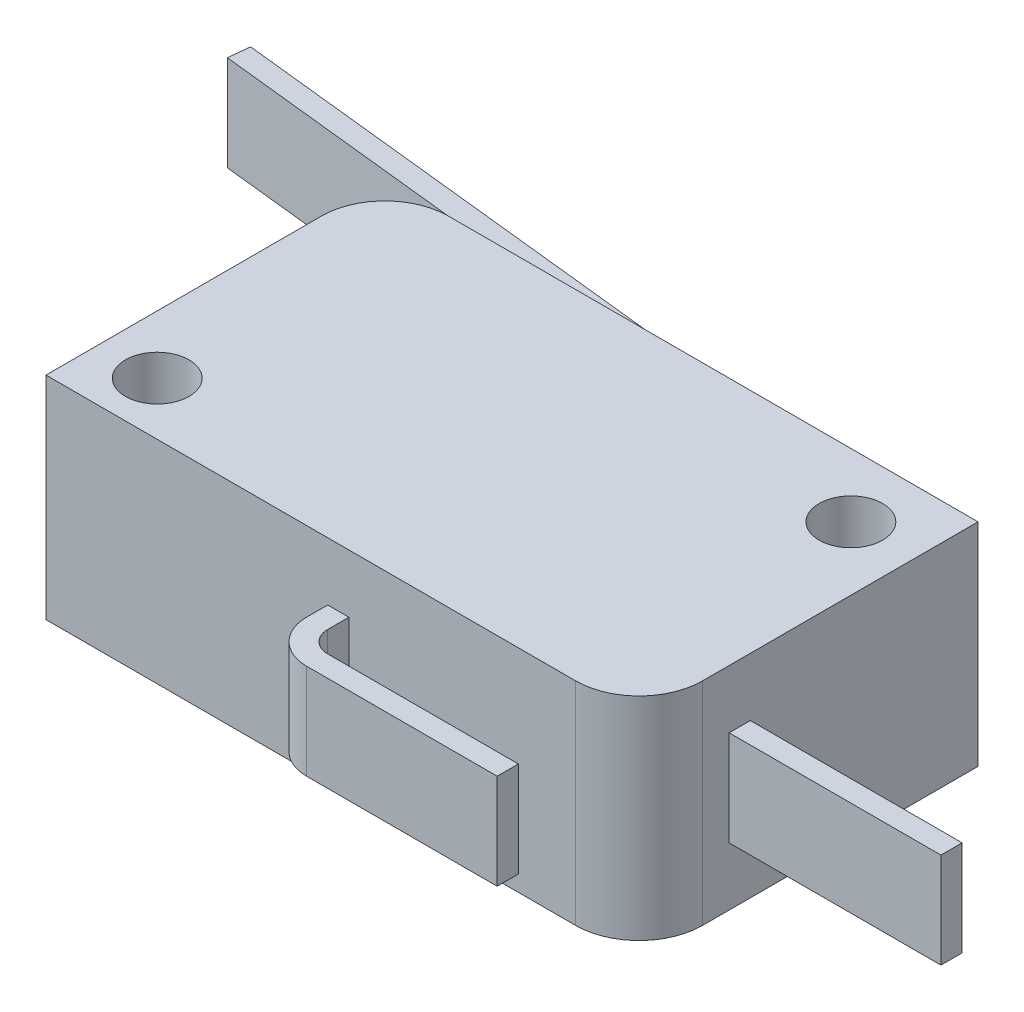
ISO-10303-21;
HEADER;
FILE_DESCRIPTION(('STEP AP214'),'2;1');
FILE_NAME('part.step','',(''),(''),'','','');
FILE_SCHEMA(('AUTOMOTIVE_DESIGN { 1 0 10303 214 1 1 1 1 }'));
ENDSEC;
DATA;
#1=APPLICATION_CONTEXT('core data for automotive mechanical design processes');
#2=APPLICATION_PROTOCOL_DEFINITION('international standard','automotive_design',2000,#1);
#3=PRODUCT_CONTEXT('',#1,'mechanical');
#4=PRODUCT('Part','Part','',(#3));
#5=PRODUCT_RELATED_PRODUCT_CATEGORY('part','',(#4));
#6=PRODUCT_DEFINITION_FORMATION('','',#4);
#7=PRODUCT_DEFINITION_CONTEXT('part definition',#1,'design');
#8=PRODUCT_DEFINITION('design','',#6,#7);
#9=PRODUCT_DEFINITION_SHAPE('','',#8);
#10=(LENGTH_UNIT() NAMED_UNIT(*) SI_UNIT(.MILLI.,.METRE.));
#11=(NAMED_UNIT(*) PLANE_ANGLE_UNIT() SI_UNIT($,.RADIAN.));
#12=(NAMED_UNIT(*) SI_UNIT($,.STERADIAN.) SOLID_ANGLE_UNIT());
#13=UNCERTAINTY_MEASURE_WITH_UNIT(LENGTH_MEASURE(1.E-05),#10,'distance_accuracy_value','');
#14=(GEOMETRIC_REPRESENTATION_CONTEXT(3) GLOBAL_UNCERTAINTY_ASSIGNED_CONTEXT((#13)) GLOBAL_UNIT_ASSIGNED_CONTEXT((#10,
#11,#12)) REPRESENTATION_CONTEXT('',''));
#15=CARTESIAN_POINT('',(0.,0.,0.));
#16=DIRECTION('',(0.,0.,1.));
#17=DIRECTION('',(1.,0.,0.));
#18=AXIS2_PLACEMENT_3D('',#15,#16,#17);
#19=CARTESIAN_POINT('',(14.,5.,0.));
#20=DIRECTION('',(-1.,0.,0.));
#21=DIRECTION('',(0.,0.,1.));
#22=AXIS2_PLACEMENT_3D('',#19,#20,#21);
#23=PLANE('',#22);
#24=DIRECTION('',(0.,0.,-1.));
#25=VECTOR('',#24,1.);
#26=CARTESIAN_POINT('',(14.,-5.,0.));
#27=LINE('',#26,#25);
#28=CARTESIAN_POINT('',(14.,-5.,4.99999999999998));
#29=VERTEX_POINT('',#28);
#30=CARTESIAN_POINT('',(14.,-5.,-8.));
#31=VERTEX_POINT('',#30);
#32=EDGE_CURVE('E386',#29,#31,#27,.T.);
#33=ORIENTED_EDGE('',*,*,#32,.T.);
#34=DIRECTION('',(0.,-1.,0.));
#35=VECTOR('',#34,1.);
#36=CARTESIAN_POINT('',(14.,5.,-8.));
#37=LINE('',#36,#35);
#38=CARTESIAN_POINT('',(14.,5.,-8.));
#39=VERTEX_POINT('',#38);
#40=EDGE_CURVE('E398',#39,#31,#37,.T.);
#41=ORIENTED_EDGE('',*,*,#40,.F.);
#42=DIRECTION('',(0.,0.,-1.));
#43=VECTOR('',#42,1.);
#44=CARTESIAN_POINT('',(14.,5.,0.));
#45=LINE('',#44,#43);
#46=CARTESIAN_POINT('',(14.,5.,4.99999999999998));
#47=VERTEX_POINT('',#46);
#48=EDGE_CURVE('E365',#47,#39,#45,.T.);
#49=ORIENTED_EDGE('',*,*,#48,.F.);
#50=DIRECTION('',(0.,-1.,0.));
#51=VECTOR('',#50,1.);
#52=CARTESIAN_POINT('',(14.,5.,4.99999999999998));
#53=LINE('',#52,#51);
#54=EDGE_CURVE('E400',#47,#29,#53,.T.);
#55=ORIENTED_EDGE('',*,*,#54,.T.);
#56=EDGE_LOOP('',(#33,#41,#49,#55));
#57=FACE_BOUND('',#56,.T.);
#58=DIRECTION('',(0.,0.,-1.));
#59=VECTOR('',#58,1.);
#60=CARTESIAN_POINT('',(14.,2.25,3.75));
#61=LINE('',#60,#59);
#62=CARTESIAN_POINT('',(14.,2.25,3.75));
#63=VERTEX_POINT('',#62);
#64=CARTESIAN_POINT('',(14.,2.25,2.75));
#65=VERTEX_POINT('',#64);
#66=EDGE_CURVE('E221',#63,#65,#61,.T.);
#67=ORIENTED_EDGE('',*,*,#66,.T.);
#68=DIRECTION('',(0.,-1.,0.));
#69=VECTOR('',#68,1.);
#70=CARTESIAN_POINT('',(14.,2.25,2.75));
#71=LINE('',#70,#69);
#72=CARTESIAN_POINT('',(14.,-2.25,2.75));
#73=VERTEX_POINT('',#72);
#74=EDGE_CURVE('E206',#65,#73,#71,.T.);
#75=ORIENTED_EDGE('',*,*,#74,.T.);
#76=DIRECTION('',(0.,0.,-1.));
#77=VECTOR('',#76,1.);
#78=CARTESIAN_POINT('',(14.,-2.25,3.75));
#79=LINE('',#78,#77);
#80=CARTESIAN_POINT('',(14.,-2.25,3.75));
#81=VERTEX_POINT('',#80);
#82=EDGE_CURVE('E211',#81,#73,#79,.T.);
#83=ORIENTED_EDGE('',*,*,#82,.F.);
#84=DIRECTION('',(0.,-1.,0.));
#85=VECTOR('',#84,1.);
#86=CARTESIAN_POINT('',(14.,2.25,3.75));
#87=LINE('',#86,#85);
#88=EDGE_CURVE('E222',#63,#81,#87,.T.);
#89=ORIENTED_EDGE('',*,*,#88,.F.);
#90=EDGE_LOOP('',(#67,#75,#83,#89));
#91=FACE_BOUND('',#90,.T.);
#92=ADVANCED_FACE('F35',(#57,#91),#23,.F.);
#93=CARTESIAN_POINT('',(0.,5.,-8.));
#94=DIRECTION('',(0.,0.,-1.));
#95=DIRECTION('',(-1.,0.,0.));
#96=AXIS2_PLACEMENT_3D('',#93,#94,#95);
#97=PLANE('',#96);
#98=DIRECTION('',(1.,0.,0.));
#99=VECTOR('',#98,1.);
#100=CARTESIAN_POINT('',(0.,-5.,-8.));
#101=LINE('',#100,#99);
#102=CARTESIAN_POINT('',(-11.,-5.,-8.));
#103=VERTEX_POINT('',#102);
#104=EDGE_CURVE('E389',#103,#31,#101,.T.);
#105=ORIENTED_EDGE('',*,*,#104,.F.);
#106=DIRECTION('',(0.,-1.,0.));
#107=VECTOR('',#106,1.);
#108=CARTESIAN_POINT('',(-11.,5.,-8.));
#109=LINE('',#108,#107);
#110=CARTESIAN_POINT('',(-11.,5.,-8.));
#111=VERTEX_POINT('',#110);
#112=EDGE_CURVE('E376',#111,#103,#109,.T.);
#113=ORIENTED_EDGE('',*,*,#112,.F.);
#114=DIRECTION('',(1.,0.,0.));
#115=VECTOR('',#114,1.);
#116=CARTESIAN_POINT('',(0.,5.,-8.));
#117=LINE('',#116,#115);
#118=EDGE_CURVE('E367',#111,#39,#117,.T.);
#119=ORIENTED_EDGE('',*,*,#118,.T.);
#120=ORIENTED_EDGE('',*,*,#40,.T.);
#121=EDGE_LOOP('',(#105,#113,#119,#120));
#122=FACE_BOUND('',#121,.T.);
#123=DIRECTION('',(0.,-1.,0.));
#124=VECTOR('',#123,1.);
#125=CARTESIAN_POINT('',(2.5,2.25,-8.));
#126=LINE('',#125,#124);
#127=CARTESIAN_POINT('',(2.5,2.25,-8.));
#128=VERTEX_POINT('',#127);
#129=CARTESIAN_POINT('',(2.5,-2.25,-8.));
#130=VERTEX_POINT('',#129);
#131=EDGE_CURVE('E348',#128,#130,#126,.T.);
#132=ORIENTED_EDGE('',*,*,#131,.F.);
#133=DIRECTION('',(-1.,0.,0.));
#134=VECTOR('',#133,1.);
#135=CARTESIAN_POINT('',(2.5,2.25,-8.));
#136=LINE('',#135,#134);
#137=CARTESIAN_POINT('',(1.5,2.25,-8.));
#138=VERTEX_POINT('',#137);
#139=EDGE_CURVE('E302',#128,#138,#136,.T.);
#140=ORIENTED_EDGE('',*,*,#139,.T.);
#141=DIRECTION('',(0.,-1.,0.));
#142=VECTOR('',#141,1.);
#143=CARTESIAN_POINT('',(1.5,2.25,-8.));
#144=LINE('',#143,#142);
#145=CARTESIAN_POINT('',(1.5,-2.25,-8.));
#146=VERTEX_POINT('',#145);
#147=EDGE_CURVE('E351',#138,#146,#144,.T.);
#148=ORIENTED_EDGE('',*,*,#147,.T.);
#149=DIRECTION('',(-1.,0.,0.));
#150=VECTOR('',#149,1.);
#151=CARTESIAN_POINT('',(2.5,-2.25,-8.));
#152=LINE('',#151,#150);
#153=EDGE_CURVE('E322',#130,#146,#152,.T.);
#154=ORIENTED_EDGE('',*,*,#153,.F.);
#155=EDGE_LOOP('',(#132,#140,#148,#154));
#156=FACE_BOUND('',#155,.T.);
#157=ADVANCED_FACE('F424',(#122,#156),#97,.T.);
#158=CARTESIAN_POINT('',(-11.,5.,-5.));
#159=DIRECTION('',(0.,-1.,0.));
#160=DIRECTION('',(0.,0.,-1.));
#161=AXIS2_PLACEMENT_3D('',#158,#159,#160);
#162=CYLINDRICAL_SURFACE('',#161,3.);
#163=CARTESIAN_POINT('',(-11.,-5.,-5.));
#164=DIRECTION('',(0.,1.,0.));
#165=DIRECTION('',(0.,0.,1.));
#166=AXIS2_PLACEMENT_3D('',#163,#164,#165);
#167=CIRCLE('',#166,3.);
#168=CARTESIAN_POINT('',(-14.,-5.,-4.99999999999998));
#169=VERTEX_POINT('',#168);
#170=EDGE_CURVE('E353',#169,#103,#167,.F.);
#171=ORIENTED_EDGE('',*,*,#170,.F.);
#172=DIRECTION('',(0.,-1.,0.));
#173=VECTOR('',#172,1.);
#174=CARTESIAN_POINT('',(-14.,5.,-4.99999999999998));
#175=LINE('',#174,#173);
#176=CARTESIAN_POINT('',(-14.,5.,-4.99999999999998));
#177=VERTEX_POINT('',#176);
#178=EDGE_CURVE('E11',#177,#169,#175,.T.);
#179=ORIENTED_EDGE('',*,*,#178,.F.);
#180=CARTESIAN_POINT('',(-11.,5.,-5.));
#181=DIRECTION('',(0.,1.,0.));
#182=DIRECTION('',(0.,0.,1.));
#183=AXIS2_PLACEMENT_3D('',#180,#181,#182);
#184=CIRCLE('',#183,3.);
#185=EDGE_CURVE('E354',#177,#111,#184,.F.);
#186=ORIENTED_EDGE('',*,*,#185,.T.);
#187=ORIENTED_EDGE('',*,*,#112,.T.);
#188=EDGE_LOOP('',(#171,#179,#186,#187));
#189=FACE_BOUND('',#188,.T.);
#190=ADVANCED_FACE('F37',(#189),#162,.T.);
#191=CARTESIAN_POINT('',(-14.,5.,0.));
#192=DIRECTION('',(-1.,0.,0.));
#193=DIRECTION('',(0.,0.,1.));
#194=AXIS2_PLACEMENT_3D('',#191,#192,#193);
#195=PLANE('',#194);
#196=DIRECTION('',(0.,0.,-1.));
#197=VECTOR('',#196,1.);
#198=CARTESIAN_POINT('',(-14.,-5.,0.));
#199=LINE('',#198,#197);
#200=CARTESIAN_POINT('',(-14.,-5.,8.));
#201=VERTEX_POINT('',#200);
#202=EDGE_CURVE('E379',#201,#169,#199,.T.);
#203=ORIENTED_EDGE('',*,*,#202,.F.);
#204=DIRECTION('',(0.,-1.,0.));
#205=VECTOR('',#204,1.);
#206=CARTESIAN_POINT('',(-14.,5.,8.));
#207=LINE('',#206,#205);
#208=CARTESIAN_POINT('',(-14.,5.,8.));
#209=VERTEX_POINT('',#208);
#210=EDGE_CURVE('E43',#209,#201,#207,.T.);
#211=ORIENTED_EDGE('',*,*,#210,.F.);
#212=DIRECTION('',(0.,0.,-1.));
#213=VECTOR('',#212,1.);
#214=CARTESIAN_POINT('',(-14.,5.,0.));
#215=LINE('',#214,#213);
#216=EDGE_CURVE('E357',#209,#177,#215,.T.);
#217=ORIENTED_EDGE('',*,*,#216,.T.);
#218=ORIENTED_EDGE('',*,*,#178,.T.);
#219=EDGE_LOOP('',(#203,#211,#217,#218));
#220=FACE_BOUND('',#219,.T.);
#221=ADVANCED_FACE('F418',(#220),#195,.T.);
#222=CARTESIAN_POINT('',(0.,5.,8.));
#223=DIRECTION('',(0.,0.,-1.));
#224=DIRECTION('',(-1.,0.,0.));
#225=AXIS2_PLACEMENT_3D('',#222,#223,#224);
#226=PLANE('',#225);
#227=DIRECTION('',(0.,-1.,0.));
#228=VECTOR('',#227,1.);
#229=CARTESIAN_POINT('',(-0.7,2.25,8.));
#230=LINE('',#229,#228);
#231=CARTESIAN_POINT('',(-0.7,2.25,8.));
#232=VERTEX_POINT('',#231);
#233=CARTESIAN_POINT('',(-0.7,-2.25,8.));
#234=VERTEX_POINT('',#233);
#235=EDGE_CURVE('E248',#232,#234,#230,.T.);
#236=ORIENTED_EDGE('',*,*,#235,.F.);
#237=DIRECTION('',(1.,0.,0.));
#238=VECTOR('',#237,1.);
#239=CARTESIAN_POINT('',(-0.7,2.25,8.));
#240=LINE('',#239,#238);
#241=CARTESIAN_POINT('',(0.3,2.25,8.));
#242=VERTEX_POINT('',#241);
#243=EDGE_CURVE('E58',#232,#242,#240,.T.);
#244=ORIENTED_EDGE('',*,*,#243,.T.);
#245=DIRECTION('',(0.,-1.,0.));
#246=VECTOR('',#245,1.);
#247=CARTESIAN_POINT('',(0.3,2.25,8.));
#248=LINE('',#247,#246);
#249=CARTESIAN_POINT('',(0.3,-2.25,8.));
#250=VERTEX_POINT('',#249);
#251=EDGE_CURVE('E246',#242,#250,#248,.T.);
#252=ORIENTED_EDGE('',*,*,#251,.T.);
#253=DIRECTION('',(1.,0.,0.));
#254=VECTOR('',#253,1.);
#255=CARTESIAN_POINT('',(-0.7,-2.25,8.));
#256=LINE('',#255,#254);
#257=EDGE_CURVE('E263',#234,#250,#256,.T.);
#258=ORIENTED_EDGE('',*,*,#257,.F.);
#259=EDGE_LOOP('',(#236,#244,#252,#258));
#260=FACE_BOUND('',#259,.T.);
#261=DIRECTION('',(1.,0.,0.));
#262=VECTOR('',#261,1.);
#263=CARTESIAN_POINT('',(0.,-5.,8.));
#264=LINE('',#263,#262);
#265=CARTESIAN_POINT('',(11.,-5.,8.));
#266=VERTEX_POINT('',#265);
#267=EDGE_CURVE('E382',#201,#266,#264,.T.);
#268=ORIENTED_EDGE('',*,*,#267,.T.);
#269=DIRECTION('',(0.,-1.,0.));
#270=VECTOR('',#269,1.);
#271=CARTESIAN_POINT('',(11.,5.,8.));
#272=LINE('',#271,#270);
#273=CARTESIAN_POINT('',(11.,5.,8.));
#274=VERTEX_POINT('',#273);
#275=EDGE_CURVE('E403',#274,#266,#272,.T.);
#276=ORIENTED_EDGE('',*,*,#275,.F.);
#277=DIRECTION('',(1.,0.,0.));
#278=VECTOR('',#277,1.);
#279=CARTESIAN_POINT('',(0.,5.,8.));
#280=LINE('',#279,#278);
#281=EDGE_CURVE('E361',#209,#274,#280,.T.);
#282=ORIENTED_EDGE('',*,*,#281,.F.);
#283=ORIENTED_EDGE('',*,*,#210,.T.);
#284=EDGE_LOOP('',(#268,#276,#282,#283));
#285=FACE_BOUND('',#284,.T.);
#286=ADVANCED_FACE('F408',(#260,#285),#226,.F.);
#287=CARTESIAN_POINT('',(11.,5.,5.));
#288=DIRECTION('',(0.,-1.,0.));
#289=DIRECTION('',(0.,0.,-1.));
#290=AXIS2_PLACEMENT_3D('',#287,#288,#289);
#291=CYLINDRICAL_SURFACE('',#290,3.);
#292=CARTESIAN_POINT('',(11.,-5.,5.));
#293=DIRECTION('',(0.,1.,0.));
#294=DIRECTION('',(0.,0.,1.));
#295=AXIS2_PLACEMENT_3D('',#292,#293,#294);
#296=CIRCLE('',#295,3.);
#297=EDGE_CURVE('E384',#266,#29,#296,.T.);
#298=ORIENTED_EDGE('',*,*,#297,.T.);
#299=ORIENTED_EDGE('',*,*,#54,.F.);
#300=CARTESIAN_POINT('',(11.,5.,5.));
#301=DIRECTION('',(0.,1.,0.));
#302=DIRECTION('',(0.,0.,1.));
#303=AXIS2_PLACEMENT_3D('',#300,#301,#302);
#304=CIRCLE('',#303,3.);
#305=EDGE_CURVE('E363',#274,#47,#304,.T.);
#306=ORIENTED_EDGE('',*,*,#305,.F.);
#307=ORIENTED_EDGE('',*,*,#275,.T.);
#308=EDGE_LOOP('',(#298,#299,#306,#307));
#309=FACE_BOUND('',#308,.T.);
#310=ADVANCED_FACE('F433',(#309),#291,.T.);
#311=CARTESIAN_POINT('',(-11.25,5.,5.5));
#312=DIRECTION('',(0.,-1.,0.));
#313=DIRECTION('',(0.,0.,-1.));
#314=AXIS2_PLACEMENT_3D('',#311,#312,#313);
#315=CYLINDRICAL_SURFACE('',#314,1.5);
#316=CARTESIAN_POINT('',(-11.25,5.,5.5));
#317=DIRECTION('',(0.,1.,0.));
#318=DIRECTION('',(0.,0.,1.));
#319=AXIS2_PLACEMENT_3D('',#316,#317,#318);
#320=CIRCLE('',#319,1.5);
#321=CARTESIAN_POINT('',(-11.25,5.,7.));
#322=VERTEX_POINT('',#321);
#323=EDGE_CURVE('E370',#322,#322,#320,.T.);
#324=ORIENTED_EDGE('',*,*,#323,.T.);
#325=EDGE_LOOP('',(#324));
#326=FACE_BOUND('',#325,.T.);
#327=CARTESIAN_POINT('',(-11.25,-5.,5.5));
#328=DIRECTION('',(0.,1.,0.));
#329=DIRECTION('',(0.,0.,1.));
#330=AXIS2_PLACEMENT_3D('',#327,#328,#329);
#331=CIRCLE('',#330,1.5);
#332=CARTESIAN_POINT('',(-11.25,-5.,7.));
#333=VERTEX_POINT('',#332);
#334=EDGE_CURVE('E392',#333,#333,#331,.T.);
#335=ORIENTED_EDGE('',*,*,#334,.F.);
#336=EDGE_LOOP('',(#335));
#337=FACE_BOUND('',#336,.T.);
#338=ADVANCED_FACE('F446',(#326,#337),#315,.F.);
#339=CARTESIAN_POINT('',(11.,5.,-5.));
#340=DIRECTION('',(0.,-1.,0.));
#341=DIRECTION('',(0.,0.,-1.));
#342=AXIS2_PLACEMENT_3D('',#339,#340,#341);
#343=CYLINDRICAL_SURFACE('',#342,1.5);
#344=CARTESIAN_POINT('',(11.,5.,-5.));
#345=DIRECTION('',(0.,1.,0.));
#346=DIRECTION('',(0.,0.,1.));
#347=AXIS2_PLACEMENT_3D('',#344,#345,#346);
#348=CIRCLE('',#347,1.5);
#349=CARTESIAN_POINT('',(11.,5.,-3.5));
#350=VERTEX_POINT('',#349);
#351=EDGE_CURVE('E373',#350,#350,#348,.T.);
#352=ORIENTED_EDGE('',*,*,#351,.T.);
#353=EDGE_LOOP('',(#352));
#354=FACE_BOUND('',#353,.T.);
#355=CARTESIAN_POINT('',(11.,-5.,-5.));
#356=DIRECTION('',(0.,1.,0.));
#357=DIRECTION('',(0.,0.,1.));
#358=AXIS2_PLACEMENT_3D('',#355,#356,#357);
#359=CIRCLE('',#358,1.5);
#360=CARTESIAN_POINT('',(11.,-5.,-3.5));
#361=VERTEX_POINT('',#360);
#362=EDGE_CURVE('E358',#361,#361,#359,.T.);
#363=ORIENTED_EDGE('',*,*,#362,.F.);
#364=EDGE_LOOP('',(#363));
#365=FACE_BOUND('',#364,.T.);
#366=ADVANCED_FACE('F438',(#354,#365),#343,.F.);
#367=CARTESIAN_POINT('',(0.,5.,0.));
#368=DIRECTION('',(0.,1.,0.));
#369=DIRECTION('',(0.,0.,1.));
#370=AXIS2_PLACEMENT_3D('',#367,#368,#369);
#371=PLANE('',#370);
#372=ORIENTED_EDGE('',*,*,#185,.F.);
#373=ORIENTED_EDGE('',*,*,#216,.F.);
#374=ORIENTED_EDGE('',*,*,#281,.T.);
#375=ORIENTED_EDGE('',*,*,#305,.T.);
#376=ORIENTED_EDGE('',*,*,#48,.T.);
#377=ORIENTED_EDGE('',*,*,#118,.F.);
#378=EDGE_LOOP('',(#372,#373,#374,#375,#376,#377));
#379=FACE_BOUND('',#378,.T.);
#380=ORIENTED_EDGE('',*,*,#323,.F.);
#381=EDGE_LOOP('',(#380));
#382=FACE_BOUND('',#381,.T.);
#383=ORIENTED_EDGE('',*,*,#351,.F.);
#384=EDGE_LOOP('',(#383));
#385=FACE_BOUND('',#384,.T.);
#386=ADVANCED_FACE('F435',(#379,#382,#385),#371,.T.);
#387=CARTESIAN_POINT('',(0.,-5.,0.));
#388=DIRECTION('',(0.,1.,0.));
#389=DIRECTION('',(0.,0.,1.));
#390=AXIS2_PLACEMENT_3D('',#387,#388,#389);
#391=PLANE('',#390);
#392=ORIENTED_EDGE('',*,*,#170,.T.);
#393=ORIENTED_EDGE('',*,*,#104,.T.);
#394=ORIENTED_EDGE('',*,*,#32,.F.);
#395=ORIENTED_EDGE('',*,*,#297,.F.);
#396=ORIENTED_EDGE('',*,*,#267,.F.);
#397=ORIENTED_EDGE('',*,*,#202,.T.);
#398=EDGE_LOOP('',(#392,#393,#394,#395,#396,#397));
#399=FACE_BOUND('',#398,.T.);
#400=ORIENTED_EDGE('',*,*,#334,.T.);
#401=EDGE_LOOP('',(#400));
#402=FACE_BOUND('',#401,.T.);
#403=ORIENTED_EDGE('',*,*,#362,.T.);
#404=EDGE_LOOP('',(#403));
#405=FACE_BOUND('',#404,.T.);
#406=ADVANCED_FACE('F415',(#399,#402,#405),#391,.F.);
#407=CARTESIAN_POINT('',(1.5,2.25,-9.10197348986612));
#408=DIRECTION('',(1.,0.,0.));
#409=DIRECTION('',(0.,0.,-1.));
#410=AXIS2_PLACEMENT_3D('',#407,#408,#409);
#411=PLANE('',#410);
#412=DIRECTION('',(0.,0.,-1.));
#413=VECTOR('',#412,1.);
#414=CARTESIAN_POINT('',(1.5,-2.25,-9.10197348986612));
#415=LINE('',#414,#413);
#416=CARTESIAN_POINT('',(1.5,-2.25,-9.10197348986613));
#417=VERTEX_POINT('',#416);
#418=EDGE_CURVE('E281',#417,#146,#415,.F.);
#419=ORIENTED_EDGE('',*,*,#418,.T.);
#420=ORIENTED_EDGE('',*,*,#147,.F.);
#421=DIRECTION('',(0.,0.,-1.));
#422=VECTOR('',#421,1.);
#423=CARTESIAN_POINT('',(1.5,2.25,-9.10197348986612));
#424=LINE('',#423,#422);
#425=CARTESIAN_POINT('',(1.5,2.25,-9.10197348986613));
#426=VERTEX_POINT('',#425);
#427=EDGE_CURVE('E299',#426,#138,#424,.F.);
#428=ORIENTED_EDGE('',*,*,#427,.F.);
#429=DIRECTION('',(0.,-1.,0.));
#430=VECTOR('',#429,1.);
#431=CARTESIAN_POINT('',(1.5,2.25,-9.10197348986613));
#432=LINE('',#431,#430);
#433=EDGE_CURVE('E319',#426,#417,#432,.T.);
#434=ORIENTED_EDGE('',*,*,#433,.T.);
#435=EDGE_LOOP('',(#419,#420,#428,#434));
#436=FACE_BOUND('',#435,.T.);
#437=ADVANCED_FACE('F451',(#436),#411,.F.);
#438=CARTESIAN_POINT('',(2.5,2.25,-9.10197348986612));
#439=DIRECTION('',(1.,0.,0.));
#440=DIRECTION('',(0.,0.,-1.));
#441=AXIS2_PLACEMENT_3D('',#438,#439,#440);
#442=PLANE('',#441);
#443=DIRECTION('',(0.,0.,1.));
#444=VECTOR('',#443,1.);
#445=CARTESIAN_POINT('',(2.5,-2.25,-9.10197348986612));
#446=LINE('',#445,#444);
#447=CARTESIAN_POINT('',(2.5,-2.25,-9.10197348986612));
#448=VERTEX_POINT('',#447);
#449=EDGE_CURVE('E325',#448,#130,#446,.T.);
#450=ORIENTED_EDGE('',*,*,#449,.F.);
#451=DIRECTION('',(0.,-1.,0.));
#452=VECTOR('',#451,1.);
#453=CARTESIAN_POINT('',(2.5,2.25,-9.10197348986612));
#454=LINE('',#453,#452);
#455=CARTESIAN_POINT('',(2.5,2.25,-9.10197348986612));
#456=VERTEX_POINT('',#455);
#457=EDGE_CURVE('E346',#456,#448,#454,.T.);
#458=ORIENTED_EDGE('',*,*,#457,.F.);
#459=DIRECTION('',(0.,0.,1.));
#460=VECTOR('',#459,1.);
#461=CARTESIAN_POINT('',(2.5,2.25,-9.10197348986612));
#462=LINE('',#461,#460);
#463=EDGE_CURVE('E305',#456,#128,#462,.T.);
#464=ORIENTED_EDGE('',*,*,#463,.T.);
#465=ORIENTED_EDGE('',*,*,#131,.T.);
#466=EDGE_LOOP('',(#450,#458,#464,#465));
#467=FACE_BOUND('',#466,.T.);
#468=ADVANCED_FACE('F456',(#467),#442,.T.);
#469=CARTESIAN_POINT('',(1.5,2.25,-9.10197348986613));
#470=DIRECTION('',(0.,-1.,0.));
#471=DIRECTION('',(0.,0.,-1.));
#472=AXIS2_PLACEMENT_3D('',#469,#470,#471);
#473=CYLINDRICAL_SURFACE('',#472,1.);
#474=CARTESIAN_POINT('',(1.5,-2.25,-9.10197348986613));
#475=DIRECTION('',(0.,-1.,0.));
#476=DIRECTION('',(0.,0.,-1.));
#477=AXIS2_PLACEMENT_3D('',#474,#475,#476);
#478=CIRCLE('',#477,1.);
#479=CARTESIAN_POINT('',(1.60714285714285,-2.25,-10.0962171260858));
#480=VERTEX_POINT('',#479);
#481=EDGE_CURVE('E328',#480,#448,#478,.T.);
#482=ORIENTED_EDGE('',*,*,#481,.F.);
#483=DIRECTION('',(0.,-1.,0.));
#484=VECTOR('',#483,1.);
#485=CARTESIAN_POINT('',(1.60714285714285,2.25,-10.0962171260858));
#486=LINE('',#485,#484);
#487=CARTESIAN_POINT('',(1.60714285714285,2.25,-10.0962171260858));
#488=VERTEX_POINT('',#487);
#489=EDGE_CURVE('E344',#488,#480,#486,.T.);
#490=ORIENTED_EDGE('',*,*,#489,.F.);
#491=CARTESIAN_POINT('',(1.5,2.25,-9.10197348986613));
#492=DIRECTION('',(0.,-1.,0.));
#493=DIRECTION('',(0.,0.,-1.));
#494=AXIS2_PLACEMENT_3D('',#491,#492,#493);
#495=CIRCLE('',#494,1.);
#496=EDGE_CURVE('E308',#488,#456,#495,.T.);
#497=ORIENTED_EDGE('',*,*,#496,.T.);
#498=ORIENTED_EDGE('',*,*,#457,.T.);
#499=EDGE_LOOP('',(#482,#490,#497,#498));
#500=FACE_BOUND('',#499,.T.);
#501=ADVANCED_FACE('F506',(#500),#473,.T.);
#502=CARTESIAN_POINT('',(-25.3388218141501,2.25,-13.));
#503=DIRECTION('',(0.107142857142857,0.,-0.994243636219647));
#504=DIRECTION('',(-0.994243636219647,0.,-0.107142857142857));
#505=AXIS2_PLACEMENT_3D('',#502,#503,#504);
#506=PLANE('',#505);
#507=DIRECTION('',(0.994243636219647,0.,0.107142857142857));
#508=VECTOR('',#507,1.);
#509=CARTESIAN_POINT('',(-25.3388218141501,-2.25,-13.));
#510=LINE('',#509,#508);
#511=CARTESIAN_POINT('',(-25.3388218141501,-2.25,-13.));
#512=VERTEX_POINT('',#511);
#513=EDGE_CURVE('E331',#512,#480,#510,.T.);
#514=ORIENTED_EDGE('',*,*,#513,.F.);
#515=DIRECTION('',(0.,-1.,0.));
#516=VECTOR('',#515,1.);
#517=CARTESIAN_POINT('',(-25.3388218141501,2.25,-13.));
#518=LINE('',#517,#516);
#519=CARTESIAN_POINT('',(-25.3388218141501,2.25,-13.));
#520=VERTEX_POINT('',#519);
#521=EDGE_CURVE('E342',#520,#512,#518,.T.);
#522=ORIENTED_EDGE('',*,*,#521,.F.);
#523=DIRECTION('',(0.994243636219647,0.,0.107142857142857));
#524=VECTOR('',#523,1.);
#525=CARTESIAN_POINT('',(-25.3388218141501,2.25,-13.));
#526=LINE('',#525,#524);
#527=EDGE_CURVE('E311',#520,#488,#526,.T.);
#528=ORIENTED_EDGE('',*,*,#527,.T.);
#529=ORIENTED_EDGE('',*,*,#489,.T.);
#530=EDGE_LOOP('',(#514,#522,#528,#529));
#531=FACE_BOUND('',#530,.T.);
#532=ADVANCED_FACE('F516',(#531),#506,.T.);
#533=CARTESIAN_POINT('',(-25.445964671293,2.25,-12.0057563637804));
#534=DIRECTION('',(-0.994243636219647,0.,-0.107142857142858));
#535=DIRECTION('',(-0.107142857142858,0.,0.994243636219647));
#536=AXIS2_PLACEMENT_3D('',#533,#534,#535);
#537=PLANE('',#536);
#538=DIRECTION('',(0.107142857142858,0.,-0.994243636219647));
#539=VECTOR('',#538,1.);
#540=CARTESIAN_POINT('',(-25.445964671293,-2.25,-12.0057563637804));
#541=LINE('',#540,#539);
#542=CARTESIAN_POINT('',(-25.445964671293,-2.25,-12.0057563637804));
#543=VERTEX_POINT('',#542);
#544=EDGE_CURVE('E334',#543,#512,#541,.T.);
#545=ORIENTED_EDGE('',*,*,#544,.F.);
#546=DIRECTION('',(0.,-1.,0.));
#547=VECTOR('',#546,1.);
#548=CARTESIAN_POINT('',(-25.445964671293,2.25,-12.0057563637804));
#549=LINE('',#548,#547);
#550=CARTESIAN_POINT('',(-25.445964671293,2.25,-12.0057563637804));
#551=VERTEX_POINT('',#550);
#552=EDGE_CURVE('E340',#551,#543,#549,.T.);
#553=ORIENTED_EDGE('',*,*,#552,.F.);
#554=DIRECTION('',(0.107142857142858,0.,-0.994243636219647));
#555=VECTOR('',#554,1.);
#556=CARTESIAN_POINT('',(-25.445964671293,2.25,-12.0057563637804));
#557=LINE('',#556,#555);
#558=EDGE_CURVE('E314',#551,#520,#557,.T.);
#559=ORIENTED_EDGE('',*,*,#558,.T.);
#560=ORIENTED_EDGE('',*,*,#521,.T.);
#561=EDGE_LOOP('',(#545,#553,#559,#560));
#562=FACE_BOUND('',#561,.T.);
#563=ADVANCED_FACE('F526',(#562),#537,.T.);
#564=CARTESIAN_POINT('',(-25.445964671293,2.25,-12.0057563637804));
#565=DIRECTION('',(0.107142857142857,0.,-0.994243636219647));
#566=DIRECTION('',(-0.994243636219647,0.,-0.107142857142857));
#567=AXIS2_PLACEMENT_3D('',#564,#565,#566);
#568=PLANE('',#567);
#569=DIRECTION('',(0.994243636219647,0.,0.107142857142857));
#570=VECTOR('',#569,1.);
#571=CARTESIAN_POINT('',(-25.445964671293,-2.25,-12.0057563637804));
#572=LINE('',#571,#570);
#573=EDGE_CURVE('E303',#543,#417,#572,.T.);
#574=ORIENTED_EDGE('',*,*,#573,.T.);
#575=ORIENTED_EDGE('',*,*,#433,.F.);
#576=DIRECTION('',(0.994243636219647,0.,0.107142857142857));
#577=VECTOR('',#576,1.);
#578=CARTESIAN_POINT('',(-25.445964671293,2.25,-12.0057563637804));
#579=LINE('',#578,#577);
#580=EDGE_CURVE('E317',#551,#426,#579,.T.);
#581=ORIENTED_EDGE('',*,*,#580,.F.);
#582=ORIENTED_EDGE('',*,*,#552,.T.);
#583=EDGE_LOOP('',(#574,#575,#581,#582));
#584=FACE_BOUND('',#583,.T.);
#585=ADVANCED_FACE('F536',(#584),#568,.F.);
#586=CARTESIAN_POINT('',(1.5,2.25,-9.10197348986613));
#587=DIRECTION('',(0.,-1.,0.));
#588=DIRECTION('',(-1.,0.,0.));
#589=AXIS2_PLACEMENT_3D('',#586,#587,#588);
#590=PLANE('',#589);
#591=ORIENTED_EDGE('',*,*,#427,.T.);
#592=ORIENTED_EDGE('',*,*,#139,.F.);
#593=ORIENTED_EDGE('',*,*,#463,.F.);
#594=ORIENTED_EDGE('',*,*,#496,.F.);
#595=ORIENTED_EDGE('',*,*,#527,.F.);
#596=ORIENTED_EDGE('',*,*,#558,.F.);
#597=ORIENTED_EDGE('',*,*,#580,.T.);
#598=EDGE_LOOP('',(#591,#592,#593,#594,#595,#596,#597));
#599=FACE_BOUND('',#598,.T.);
#600=ADVANCED_FACE('F546',(#599),#590,.F.);
#601=CARTESIAN_POINT('',(1.5,-2.25,-9.10197348986613));
#602=DIRECTION('',(0.,-1.,0.));
#603=DIRECTION('',(-1.,0.,0.));
#604=AXIS2_PLACEMENT_3D('',#601,#602,#603);
#605=PLANE('',#604);
#606=ORIENTED_EDGE('',*,*,#418,.F.);
#607=ORIENTED_EDGE('',*,*,#573,.F.);
#608=ORIENTED_EDGE('',*,*,#544,.T.);
#609=ORIENTED_EDGE('',*,*,#513,.T.);
#610=ORIENTED_EDGE('',*,*,#481,.T.);
#611=ORIENTED_EDGE('',*,*,#449,.T.);
#612=ORIENTED_EDGE('',*,*,#153,.T.);
#613=EDGE_LOOP('',(#606,#607,#608,#609,#610,#611,#612));
#614=FACE_BOUND('',#613,.T.);
#615=ADVANCED_FACE('F556',(#614),#605,.T.);
#616=CARTESIAN_POINT('',(1.3,2.25,11.));
#617=DIRECTION('',(0.,0.,-1.));
#618=DIRECTION('',(-1.,0.,0.));
#619=AXIS2_PLACEMENT_3D('',#616,#617,#618);
#620=PLANE('',#619);
#621=DIRECTION('',(1.,0.,0.));
#622=VECTOR('',#621,1.);
#623=CARTESIAN_POINT('',(1.3,-2.25,11.));
#624=LINE('',#623,#622);
#625=CARTESIAN_POINT('',(1.3,-2.25,11.));
#626=VERTEX_POINT('',#625);
#627=CARTESIAN_POINT('',(10.3,-2.25,11.));
#628=VERTEX_POINT('',#627);
#629=EDGE_CURVE('E278',#626,#628,#624,.T.);
#630=ORIENTED_EDGE('',*,*,#629,.T.);
#631=DIRECTION('',(0.,-1.,0.));
#632=VECTOR('',#631,1.);
#633=CARTESIAN_POINT('',(10.3,2.25,11.));
#634=LINE('',#633,#632);
#635=CARTESIAN_POINT('',(10.3,2.25,11.));
#636=VERTEX_POINT('',#635);
#637=EDGE_CURVE('E231',#636,#628,#634,.T.);
#638=ORIENTED_EDGE('',*,*,#637,.F.);
#639=DIRECTION('',(1.,0.,0.));
#640=VECTOR('',#639,1.);
#641=CARTESIAN_POINT('',(1.3,2.25,11.));
#642=LINE('',#641,#640);
#643=CARTESIAN_POINT('',(1.3,2.25,11.));
#644=VERTEX_POINT('',#643);
#645=EDGE_CURVE('E261',#644,#636,#642,.T.);
#646=ORIENTED_EDGE('',*,*,#645,.F.);
#647=DIRECTION('',(0.,-1.,0.));
#648=VECTOR('',#647,1.);
#649=CARTESIAN_POINT('',(1.3,2.25,11.));
#650=LINE('',#649,#648);
#651=EDGE_CURVE('E254',#644,#626,#650,.T.);
#652=ORIENTED_EDGE('',*,*,#651,.T.);
#653=EDGE_LOOP('',(#630,#638,#646,#652));
#654=FACE_BOUND('',#653,.T.);
#655=ADVANCED_FACE('F566',(#654),#620,.F.);
#656=CARTESIAN_POINT('',(10.3,2.25,10.));
#657=DIRECTION('',(1.,0.,0.));
#658=DIRECTION('',(0.,0.,-1.));
#659=AXIS2_PLACEMENT_3D('',#656,#657,#658);
#660=PLANE('',#659);
#661=DIRECTION('',(0.,0.,1.));
#662=VECTOR('',#661,1.);
#663=CARTESIAN_POINT('',(10.3,-2.25,10.));
#664=LINE('',#663,#662);
#665=CARTESIAN_POINT('',(10.3,-2.25,10.));
#666=VERTEX_POINT('',#665);
#667=EDGE_CURVE('E275',#666,#628,#664,.T.);
#668=ORIENTED_EDGE('',*,*,#667,.F.);
#669=DIRECTION('',(0.,-1.,0.));
#670=VECTOR('',#669,1.);
#671=CARTESIAN_POINT('',(10.3,2.25,10.));
#672=LINE('',#671,#670);
#673=CARTESIAN_POINT('',(10.3,2.25,10.));
#674=VERTEX_POINT('',#673);
#675=EDGE_CURVE('E240',#674,#666,#672,.T.);
#676=ORIENTED_EDGE('',*,*,#675,.F.);
#677=DIRECTION('',(0.,0.,1.));
#678=VECTOR('',#677,1.);
#679=CARTESIAN_POINT('',(10.3,2.25,10.));
#680=LINE('',#679,#678);
#681=EDGE_CURVE('E295',#674,#636,#680,.T.);
#682=ORIENTED_EDGE('',*,*,#681,.T.);
#683=ORIENTED_EDGE('',*,*,#637,.T.);
#684=EDGE_LOOP('',(#668,#676,#682,#683));
#685=FACE_BOUND('',#684,.T.);
#686=ADVANCED_FACE('F576',(#685),#660,.T.);
#687=CARTESIAN_POINT('',(1.3,2.25,10.));
#688=DIRECTION('',(0.,0.,-1.));
#689=DIRECTION('',(-1.,0.,0.));
#690=AXIS2_PLACEMENT_3D('',#687,#688,#689);
#691=PLANE('',#690);
#692=DIRECTION('',(1.,0.,0.));
#693=VECTOR('',#692,1.);
#694=CARTESIAN_POINT('',(1.3,-2.25,10.));
#695=LINE('',#694,#693);
#696=CARTESIAN_POINT('',(1.3,-2.25,10.));
#697=VERTEX_POINT('',#696);
#698=EDGE_CURVE('E272',#697,#666,#695,.T.);
#699=ORIENTED_EDGE('',*,*,#698,.F.);
#700=DIRECTION('',(0.,-1.,0.));
#701=VECTOR('',#700,1.);
#702=CARTESIAN_POINT('',(1.3,2.25,10.));
#703=LINE('',#702,#701);
#704=CARTESIAN_POINT('',(1.3,2.25,10.));
#705=VERTEX_POINT('',#704);
#706=EDGE_CURVE('E242',#705,#697,#703,.T.);
#707=ORIENTED_EDGE('',*,*,#706,.F.);
#708=DIRECTION('',(1.,0.,0.));
#709=VECTOR('',#708,1.);
#710=CARTESIAN_POINT('',(1.3,2.25,10.));
#711=LINE('',#710,#709);
#712=EDGE_CURVE('E292',#705,#674,#711,.T.);
#713=ORIENTED_EDGE('',*,*,#712,.T.);
#714=ORIENTED_EDGE('',*,*,#675,.T.);
#715=EDGE_LOOP('',(#699,#707,#713,#714));
#716=FACE_BOUND('',#715,.T.);
#717=ADVANCED_FACE('F586',(#716),#691,.T.);
#718=CARTESIAN_POINT('',(1.3,2.25,9.));
#719=DIRECTION('',(0.,-1.,0.));
#720=DIRECTION('',(0.,0.,-1.));
#721=AXIS2_PLACEMENT_3D('',#718,#719,#720);
#722=CYLINDRICAL_SURFACE('',#721,1.);
#723=CARTESIAN_POINT('',(1.3,-2.25,9.));
#724=DIRECTION('',(0.,1.,0.));
#725=DIRECTION('',(0.,0.,1.));
#726=AXIS2_PLACEMENT_3D('',#723,#724,#725);
#727=CIRCLE('',#726,1.);
#728=CARTESIAN_POINT('',(0.3,-2.25,9.));
#729=VERTEX_POINT('',#728);
#730=EDGE_CURVE('E269',#729,#697,#727,.T.);
#731=ORIENTED_EDGE('',*,*,#730,.F.);
#732=DIRECTION('',(0.,-1.,0.));
#733=VECTOR('',#732,1.);
#734=CARTESIAN_POINT('',(0.3,2.25,9.));
#735=LINE('',#734,#733);
#736=CARTESIAN_POINT('',(0.3,2.25,9.));
#737=VERTEX_POINT('',#736);
#738=EDGE_CURVE('E244',#737,#729,#735,.T.);
#739=ORIENTED_EDGE('',*,*,#738,.F.);
#740=CARTESIAN_POINT('',(1.3,2.25,9.));
#741=DIRECTION('',(0.,1.,0.));
#742=DIRECTION('',(0.,0.,1.));
#743=AXIS2_PLACEMENT_3D('',#740,#741,#742);
#744=CIRCLE('',#743,1.);
#745=EDGE_CURVE('E289',#737,#705,#744,.T.);
#746=ORIENTED_EDGE('',*,*,#745,.T.);
#747=ORIENTED_EDGE('',*,*,#706,.T.);
#748=EDGE_LOOP('',(#731,#739,#746,#747));
#749=FACE_BOUND('',#748,.T.);
#750=ADVANCED_FACE('F596',(#749),#722,.F.);
#751=CARTESIAN_POINT('',(0.3,2.25,8.));
#752=DIRECTION('',(1.,0.,0.));
#753=DIRECTION('',(0.,0.,-1.));
#754=AXIS2_PLACEMENT_3D('',#751,#752,#753);
#755=PLANE('',#754);
#756=DIRECTION('',(0.,0.,1.));
#757=VECTOR('',#756,1.);
#758=CARTESIAN_POINT('',(0.3,-2.25,8.));
#759=LINE('',#758,#757);
#760=EDGE_CURVE('E266',#250,#729,#759,.T.);
#761=ORIENTED_EDGE('',*,*,#760,.F.);
#762=ORIENTED_EDGE('',*,*,#251,.F.);
#763=DIRECTION('',(0.,0.,1.));
#764=VECTOR('',#763,1.);
#765=CARTESIAN_POINT('',(0.3,2.25,8.));
#766=LINE('',#765,#764);
#767=EDGE_CURVE('E286',#242,#737,#766,.T.);
#768=ORIENTED_EDGE('',*,*,#767,.T.);
#769=ORIENTED_EDGE('',*,*,#738,.T.);
#770=EDGE_LOOP('',(#761,#762,#768,#769));
#771=FACE_BOUND('',#770,.T.);
#772=ADVANCED_FACE('F606',(#771),#755,.T.);
#773=CARTESIAN_POINT('',(-0.7,2.25,8.));
#774=DIRECTION('',(1.,0.,0.));
#775=DIRECTION('',(0.,0.,-1.));
#776=AXIS2_PLACEMENT_3D('',#773,#774,#775);
#777=PLANE('',#776);
#778=DIRECTION('',(0.,0.,1.));
#779=VECTOR('',#778,1.);
#780=CARTESIAN_POINT('',(-0.7,-2.25,8.));
#781=LINE('',#780,#779);
#782=CARTESIAN_POINT('',(-0.7,-2.25,9.));
#783=VERTEX_POINT('',#782);
#784=EDGE_CURVE('E260',#234,#783,#781,.T.);
#785=ORIENTED_EDGE('',*,*,#784,.T.);
#786=DIRECTION('',(0.,-1.,0.));
#787=VECTOR('',#786,1.);
#788=CARTESIAN_POINT('',(-0.7,2.25,9.));
#789=LINE('',#788,#787);
#790=CARTESIAN_POINT('',(-0.7,2.25,9.));
#791=VERTEX_POINT('',#790);
#792=EDGE_CURVE('E251',#791,#783,#789,.T.);
#793=ORIENTED_EDGE('',*,*,#792,.F.);
#794=DIRECTION('',(0.,0.,1.));
#795=VECTOR('',#794,1.);
#796=CARTESIAN_POINT('',(-0.7,2.25,8.));
#797=LINE('',#796,#795);
#798=EDGE_CURVE('E283',#232,#791,#797,.T.);
#799=ORIENTED_EDGE('',*,*,#798,.F.);
#800=ORIENTED_EDGE('',*,*,#235,.T.);
#801=EDGE_LOOP('',(#785,#793,#799,#800));
#802=FACE_BOUND('',#801,.T.);
#803=ADVANCED_FACE('F616',(#802),#777,.F.);
#804=CARTESIAN_POINT('',(1.3,2.25,9.));
#805=DIRECTION('',(0.,-1.,0.));
#806=DIRECTION('',(0.,0.,-1.));
#807=AXIS2_PLACEMENT_3D('',#804,#805,#806);
#808=CYLINDRICAL_SURFACE('',#807,2.);
#809=CARTESIAN_POINT('',(1.3,-2.25,9.));
#810=DIRECTION('',(0.,1.,0.));
#811=DIRECTION('',(1.,0.,0.));
#812=AXIS2_PLACEMENT_3D('',#809,#810,#811);
#813=CIRCLE('',#812,2.);
#814=EDGE_CURVE('E258',#783,#626,#813,.T.);
#815=ORIENTED_EDGE('',*,*,#814,.T.);
#816=ORIENTED_EDGE('',*,*,#651,.F.);
#817=CARTESIAN_POINT('',(1.3,2.25,9.));
#818=DIRECTION('',(0.,1.,0.));
#819=DIRECTION('',(1.,0.,0.));
#820=AXIS2_PLACEMENT_3D('',#817,#818,#819);
#821=CIRCLE('',#820,2.);
#822=EDGE_CURVE('E257',#791,#644,#821,.T.);
#823=ORIENTED_EDGE('',*,*,#822,.F.);
#824=ORIENTED_EDGE('',*,*,#792,.T.);
#825=EDGE_LOOP('',(#815,#816,#823,#824));
#826=FACE_BOUND('',#825,.T.);
#827=ADVANCED_FACE('F626',(#826),#808,.T.);
#828=CARTESIAN_POINT('',(1.3,2.25,9.));
#829=DIRECTION('',(0.,1.,0.));
#830=DIRECTION('',(1.,0.,0.));
#831=AXIS2_PLACEMENT_3D('',#828,#829,#830);
#832=PLANE('',#831);
#833=ORIENTED_EDGE('',*,*,#645,.T.);
#834=ORIENTED_EDGE('',*,*,#681,.F.);
#835=ORIENTED_EDGE('',*,*,#712,.F.);
#836=ORIENTED_EDGE('',*,*,#745,.F.);
#837=ORIENTED_EDGE('',*,*,#767,.F.);
#838=ORIENTED_EDGE('',*,*,#243,.F.);
#839=ORIENTED_EDGE('',*,*,#798,.T.);
#840=ORIENTED_EDGE('',*,*,#822,.T.);
#841=EDGE_LOOP('',(#833,#834,#835,#836,#837,#838,#839,#840));
#842=FACE_BOUND('',#841,.T.);
#843=ADVANCED_FACE('F636',(#842),#832,.T.);
#844=CARTESIAN_POINT('',(1.3,-2.25,9.));
#845=DIRECTION('',(0.,1.,0.));
#846=DIRECTION('',(1.,0.,0.));
#847=AXIS2_PLACEMENT_3D('',#844,#845,#846);
#848=PLANE('',#847);
#849=ORIENTED_EDGE('',*,*,#629,.F.);
#850=ORIENTED_EDGE('',*,*,#814,.F.);
#851=ORIENTED_EDGE('',*,*,#784,.F.);
#852=ORIENTED_EDGE('',*,*,#257,.T.);
#853=ORIENTED_EDGE('',*,*,#760,.T.);
#854=ORIENTED_EDGE('',*,*,#730,.T.);
#855=ORIENTED_EDGE('',*,*,#698,.T.);
#856=ORIENTED_EDGE('',*,*,#667,.T.);
#857=EDGE_LOOP('',(#849,#850,#851,#852,#853,#854,#855,#856));
#858=FACE_BOUND('',#857,.T.);
#859=ADVANCED_FACE('F646',(#858),#848,.F.);
#860=CARTESIAN_POINT('',(14.,2.25,3.75));
#861=DIRECTION('',(0.,0.,-1.));
#862=DIRECTION('',(-1.,0.,0.));
#863=AXIS2_PLACEMENT_3D('',#860,#861,#862);
#864=PLANE('',#863);
#865=DIRECTION('',(1.,0.,0.));
#866=VECTOR('',#865,1.);
#867=CARTESIAN_POINT('',(14.,-2.25,3.75));
#868=LINE('',#867,#866);
#869=CARTESIAN_POINT('',(24.,-2.25,3.75));
#870=VERTEX_POINT('',#869);
#871=EDGE_CURVE('E50',#81,#870,#868,.T.);
#872=ORIENTED_EDGE('',*,*,#871,.T.);
#873=DIRECTION('',(0.,-1.,0.));
#874=VECTOR('',#873,1.);
#875=CARTESIAN_POINT('',(24.,2.25,3.75));
#876=LINE('',#875,#874);
#877=CARTESIAN_POINT('',(24.,2.25,3.75));
#878=VERTEX_POINT('',#877);
#879=EDGE_CURVE('E225',#878,#870,#876,.T.);
#880=ORIENTED_EDGE('',*,*,#879,.F.);
#881=DIRECTION('',(1.,0.,0.));
#882=VECTOR('',#881,1.);
#883=CARTESIAN_POINT('',(14.,2.25,3.75));
#884=LINE('',#883,#882);
#885=EDGE_CURVE('E217',#63,#878,#884,.T.);
#886=ORIENTED_EDGE('',*,*,#885,.F.);
#887=ORIENTED_EDGE('',*,*,#88,.T.);
#888=EDGE_LOOP('',(#872,#880,#886,#887));
#889=FACE_BOUND('',#888,.T.);
#890=ADVANCED_FACE('F656',(#889),#864,.F.);
#891=CARTESIAN_POINT('',(24.,2.25,2.75));
#892=DIRECTION('',(1.,0.,0.));
#893=DIRECTION('',(0.,0.,-1.));
#894=AXIS2_PLACEMENT_3D('',#891,#892,#893);
#895=PLANE('',#894);
#896=DIRECTION('',(0.,0.,1.));
#897=VECTOR('',#896,1.);
#898=CARTESIAN_POINT('',(24.,-2.25,2.75));
#899=LINE('',#898,#897);
#900=CARTESIAN_POINT('',(24.,-2.25,2.75));
#901=VERTEX_POINT('',#900);
#902=EDGE_CURVE('E210',#901,#870,#899,.T.);
#903=ORIENTED_EDGE('',*,*,#902,.F.);
#904=DIRECTION('',(0.,-1.,0.));
#905=VECTOR('',#904,1.);
#906=CARTESIAN_POINT('',(24.,2.25,2.75));
#907=LINE('',#906,#905);
#908=CARTESIAN_POINT('',(24.,2.25,2.75));
#909=VERTEX_POINT('',#908);
#910=EDGE_CURVE('E208',#909,#901,#907,.T.);
#911=ORIENTED_EDGE('',*,*,#910,.F.);
#912=DIRECTION('',(0.,0.,1.));
#913=VECTOR('',#912,1.);
#914=CARTESIAN_POINT('',(24.,2.25,2.75));
#915=LINE('',#914,#913);
#916=EDGE_CURVE('E235',#909,#878,#915,.T.);
#917=ORIENTED_EDGE('',*,*,#916,.T.);
#918=ORIENTED_EDGE('',*,*,#879,.T.);
#919=EDGE_LOOP('',(#903,#911,#917,#918));
#920=FACE_BOUND('',#919,.T.);
#921=ADVANCED_FACE('F666',(#920),#895,.T.);
#922=CARTESIAN_POINT('',(14.,2.25,2.75));
#923=DIRECTION('',(0.,0.,-1.));
#924=DIRECTION('',(-1.,0.,0.));
#925=AXIS2_PLACEMENT_3D('',#922,#923,#924);
#926=PLANE('',#925);
#927=DIRECTION('',(1.,0.,0.));
#928=VECTOR('',#927,1.);
#929=CARTESIAN_POINT('',(14.,-2.25,2.75));
#930=LINE('',#929,#928);
#931=EDGE_CURVE('E202',#73,#901,#930,.T.);
#932=ORIENTED_EDGE('',*,*,#931,.F.);
#933=ORIENTED_EDGE('',*,*,#74,.F.);
#934=DIRECTION('',(1.,0.,0.));
#935=VECTOR('',#934,1.);
#936=CARTESIAN_POINT('',(14.,2.25,2.75));
#937=LINE('',#936,#935);
#938=EDGE_CURVE('E233',#65,#909,#937,.T.);
#939=ORIENTED_EDGE('',*,*,#938,.T.);
#940=ORIENTED_EDGE('',*,*,#910,.T.);
#941=EDGE_LOOP('',(#932,#933,#939,#940));
#942=FACE_BOUND('',#941,.T.);
#943=ADVANCED_FACE('F203',(#942),#926,.T.);
#944=CARTESIAN_POINT('',(0.,2.25,0.));
#945=DIRECTION('',(0.,-1.,0.));
#946=DIRECTION('',(-1.,0.,0.));
#947=AXIS2_PLACEMENT_3D('',#944,#945,#946);
#948=PLANE('',#947);
#949=ORIENTED_EDGE('',*,*,#885,.T.);
#950=ORIENTED_EDGE('',*,*,#916,.F.);
#951=ORIENTED_EDGE('',*,*,#938,.F.);
#952=ORIENTED_EDGE('',*,*,#66,.F.);
#953=EDGE_LOOP('',(#949,#950,#951,#952));
#954=FACE_BOUND('',#953,.T.);
#955=ADVANCED_FACE('F685',(#954),#948,.F.);
#956=CARTESIAN_POINT('',(0.,-2.25,0.));
#957=DIRECTION('',(0.,-1.,0.));
#958=DIRECTION('',(-1.,0.,0.));
#959=AXIS2_PLACEMENT_3D('',#956,#957,#958);
#960=PLANE('',#959);
#961=ORIENTED_EDGE('',*,*,#871,.F.);
#962=ORIENTED_EDGE('',*,*,#82,.T.);
#963=ORIENTED_EDGE('',*,*,#931,.T.);
#964=ORIENTED_EDGE('',*,*,#902,.T.);
#965=EDGE_LOOP('',(#961,#962,#963,#964));
#966=FACE_BOUND('',#965,.T.);
#967=ADVANCED_FACE('F214',(#966),#960,.T.);
#968=CLOSED_SHELL('',(#92,#157,#190,#221,#286,#310,#338,#366,#386,#406,#437,#468,#501,#532,#563,
#585,#600,#615,#655,#686,#717,#750,#772,#803,#827,#843,#859,#890,#921,#943,#955,#967));
#969=MANIFOLD_SOLID_BREP('B2',#968);
#970=ADVANCED_BREP_SHAPE_REPRESENTATION('',(#18,#969),#14);
#971=SHAPE_DEFINITION_REPRESENTATION(#9,#970);
ENDSEC;
END-ISO-10303-21;
